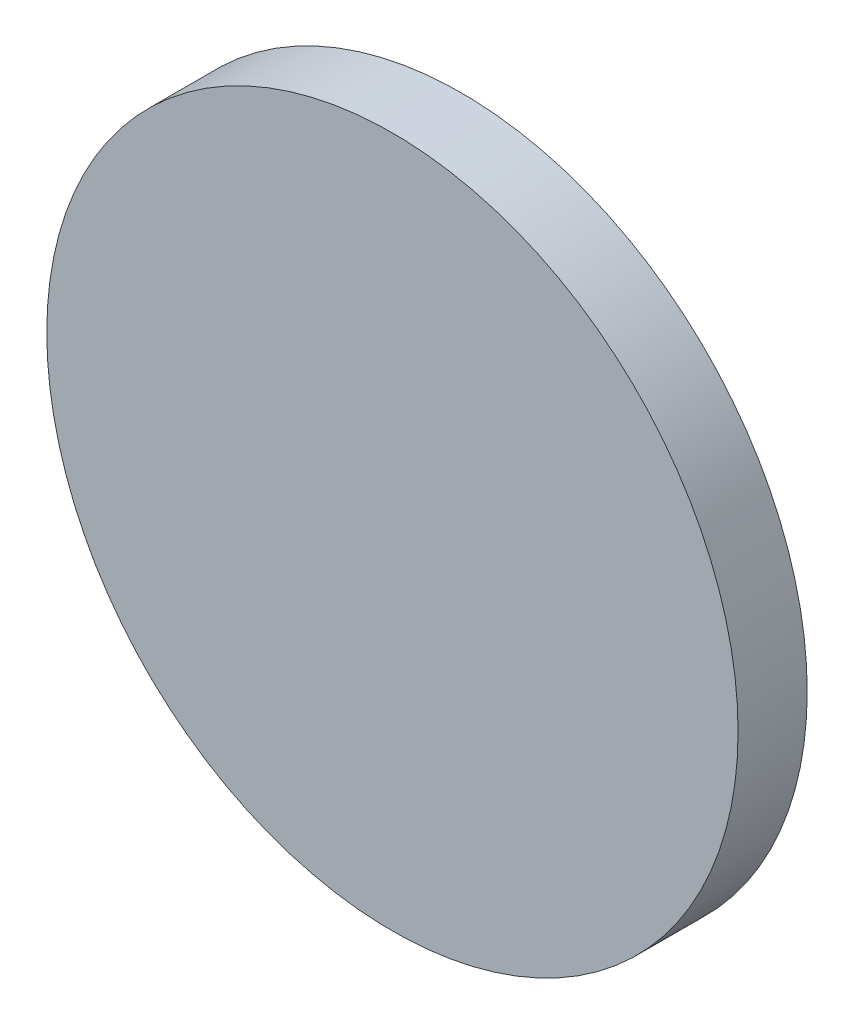
ISO-10303-21;
HEADER;
FILE_DESCRIPTION(('STEP AP214'),'2;1');
FILE_NAME('part.step','',(''),(''),'','','');
FILE_SCHEMA(('AUTOMOTIVE_DESIGN { 1 0 10303 214 1 1 1 1 }'));
ENDSEC;
DATA;
#1=APPLICATION_CONTEXT('core data for automotive mechanical design processes');
#2=APPLICATION_PROTOCOL_DEFINITION('international standard','automotive_design',2000,#1);
#3=PRODUCT_CONTEXT('',#1,'mechanical');
#4=PRODUCT('Part','Part','',(#3));
#5=PRODUCT_RELATED_PRODUCT_CATEGORY('part','',(#4));
#6=PRODUCT_DEFINITION_FORMATION('','',#4);
#7=PRODUCT_DEFINITION_CONTEXT('part definition',#1,'design');
#8=PRODUCT_DEFINITION('design','',#6,#7);
#9=PRODUCT_DEFINITION_SHAPE('','',#8);
#10=(LENGTH_UNIT() NAMED_UNIT(*) SI_UNIT(.MILLI.,.METRE.));
#11=(NAMED_UNIT(*) PLANE_ANGLE_UNIT() SI_UNIT($,.RADIAN.));
#12=(NAMED_UNIT(*) SI_UNIT($,.STERADIAN.) SOLID_ANGLE_UNIT());
#13=UNCERTAINTY_MEASURE_WITH_UNIT(LENGTH_MEASURE(1.E-05),#10,'distance_accuracy_value','');
#14=(GEOMETRIC_REPRESENTATION_CONTEXT(3) GLOBAL_UNCERTAINTY_ASSIGNED_CONTEXT((#13)) GLOBAL_UNIT_ASSIGNED_CONTEXT((#10,
#11,#12)) REPRESENTATION_CONTEXT('',''));
#15=CARTESIAN_POINT('',(0.,0.,0.));
#16=DIRECTION('',(0.,0.,1.));
#17=DIRECTION('',(1.,0.,0.));
#18=AXIS2_PLACEMENT_3D('',#15,#16,#17);
#19=CARTESIAN_POINT('',(0.635,0.,0.127));
#20=DIRECTION('',(0.,0.,-1.));
#21=DIRECTION('',(-1.,0.,0.));
#22=AXIS2_PLACEMENT_3D('',#19,#20,#21);
#23=PLANE('',#22);
#24=CARTESIAN_POINT('',(0.,0.,0.127));
#25=DIRECTION('',(0.,0.,-1.));
#26=DIRECTION('',(-1.,0.,0.));
#27=AXIS2_PLACEMENT_3D('',#24,#25,#26);
#28=CIRCLE('',#27,0.635);
#29=CARTESIAN_POINT('',(-0.635,0.,0.127));
#30=VERTEX_POINT('',#29);
#31=EDGE_CURVE('E18',#30,#30,#28,.T.);
#32=ORIENTED_EDGE('',*,*,#31,.F.);
#33=EDGE_LOOP('',(#32));
#34=FACE_BOUND('',#33,.T.);
#35=ADVANCED_FACE('F15',(#34),#23,.F.);
#36=CARTESIAN_POINT('',(0.,0.,0.));
#37=DIRECTION('',(0.,0.,-1.));
#38=DIRECTION('',(-1.,0.,0.));
#39=AXIS2_PLACEMENT_3D('',#36,#37,#38);
#40=CYLINDRICAL_SURFACE('',#39,0.635);
#41=ORIENTED_EDGE('',*,*,#31,.T.);
#42=EDGE_LOOP('',(#41));
#43=FACE_BOUND('',#42,.T.);
#44=CARTESIAN_POINT('',(0.,0.,0.));
#45=DIRECTION('',(0.,0.,-1.));
#46=DIRECTION('',(-1.,0.,0.));
#47=AXIS2_PLACEMENT_3D('',#44,#45,#46);
#48=CIRCLE('',#47,0.635);
#49=CARTESIAN_POINT('',(-0.635,0.,0.));
#50=VERTEX_POINT('',#49);
#51=EDGE_CURVE('E10',#50,#50,#48,.T.);
#52=ORIENTED_EDGE('',*,*,#51,.F.);
#53=EDGE_LOOP('',(#52));
#54=FACE_BOUND('',#53,.T.);
#55=ADVANCED_FACE('F27',(#43,#54),#40,.T.);
#56=CARTESIAN_POINT('',(0.635,0.,0.));
#57=DIRECTION('',(0.,0.,-1.));
#58=DIRECTION('',(-1.,0.,0.));
#59=AXIS2_PLACEMENT_3D('',#56,#57,#58);
#60=PLANE('',#59);
#61=ORIENTED_EDGE('',*,*,#51,.T.);
#62=EDGE_LOOP('',(#61));
#63=FACE_BOUND('',#62,.T.);
#64=ADVANCED_FACE('F35',(#63),#60,.T.);
#65=CLOSED_SHELL('',(#35,#55,#64));
#66=MANIFOLD_SOLID_BREP('B1',#65);
#67=ADVANCED_BREP_SHAPE_REPRESENTATION('',(#18,#66),#14);
#68=SHAPE_DEFINITION_REPRESENTATION(#9,#67);
ENDSEC;
END-ISO-10303-21;
